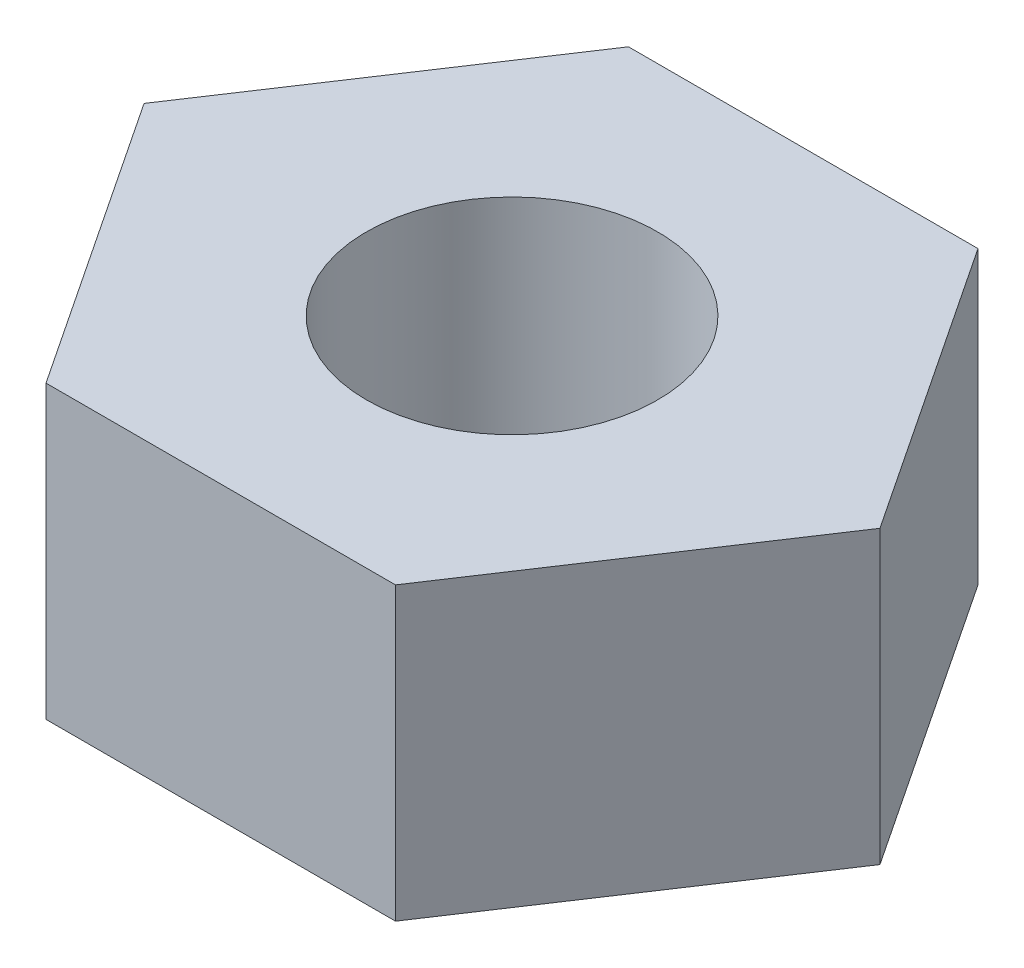
ISO-10303-21;
HEADER;
FILE_DESCRIPTION(('STEP AP214'),'2;1');
FILE_NAME('part.step','',(''),(''),'','','');
FILE_SCHEMA(('AUTOMOTIVE_DESIGN { 1 0 10303 214 1 1 1 1 }'));
ENDSEC;
DATA;
#1=APPLICATION_CONTEXT('core data for automotive mechanical design processes');
#2=APPLICATION_PROTOCOL_DEFINITION('international standard','automotive_design',2000,#1);
#3=PRODUCT_CONTEXT('',#1,'mechanical');
#4=PRODUCT('Part','Part','',(#3));
#5=PRODUCT_RELATED_PRODUCT_CATEGORY('part','',(#4));
#6=PRODUCT_DEFINITION_FORMATION('','',#4);
#7=PRODUCT_DEFINITION_CONTEXT('part definition',#1,'design');
#8=PRODUCT_DEFINITION('design','',#6,#7);
#9=PRODUCT_DEFINITION_SHAPE('','',#8);
#10=(LENGTH_UNIT() NAMED_UNIT(*) SI_UNIT(.MILLI.,.METRE.));
#11=(NAMED_UNIT(*) PLANE_ANGLE_UNIT() SI_UNIT($,.RADIAN.));
#12=(NAMED_UNIT(*) SI_UNIT($,.STERADIAN.) SOLID_ANGLE_UNIT());
#13=UNCERTAINTY_MEASURE_WITH_UNIT(LENGTH_MEASURE(1.E-05),#10,'distance_accuracy_value','');
#14=(GEOMETRIC_REPRESENTATION_CONTEXT(3) GLOBAL_UNCERTAINTY_ASSIGNED_CONTEXT((#13)) GLOBAL_UNIT_ASSIGNED_CONTEXT((#10,
#11,#12)) REPRESENTATION_CONTEXT('',''));
#15=CARTESIAN_POINT('',(0.,0.,0.));
#16=DIRECTION('',(0.,0.,1.));
#17=DIRECTION('',(1.,0.,0.));
#18=AXIS2_PLACEMENT_3D('',#15,#16,#17);
#19=CARTESIAN_POINT('',(0.,10.,0.));
#20=DIRECTION('',(0.,-1.,0.));
#21=DIRECTION('',(0.,0.,-1.));
#22=AXIS2_PLACEMENT_3D('',#19,#20,#21);
#23=PLANE('',#22);
#24=DIRECTION('',(-0.552770798392566,0.,0.833333333333333));
#25=VECTOR('',#24,1.);
#26=CARTESIAN_POINT('',(-12.635,10.,0.));
#27=LINE('',#26,#25);
#28=CARTESIAN_POINT('',(-6.0017504192892,10.,-10.));
#29=VERTEX_POINT('',#28);
#30=CARTESIAN_POINT('',(-12.635,10.,0.));
#31=VERTEX_POINT('',#30);
#32=EDGE_CURVE('E150',#29,#31,#27,.T.);
#33=ORIENTED_EDGE('',*,*,#32,.T.);
#34=DIRECTION('',(0.552770798392566,0.,0.833333333333333));
#35=VECTOR('',#34,1.);
#36=CARTESIAN_POINT('',(-6.0017504192892,10.,10.));
#37=LINE('',#36,#35);
#38=CARTESIAN_POINT('',(-6.0017504192892,10.,10.));
#39=VERTEX_POINT('',#38);
#40=EDGE_CURVE('E98',#31,#39,#37,.T.);
#41=ORIENTED_EDGE('',*,*,#40,.T.);
#42=DIRECTION('',(1.,0.,0.));
#43=VECTOR('',#42,1.);
#44=CARTESIAN_POINT('',(5.9982495807108,10.,10.));
#45=LINE('',#44,#43);
#46=CARTESIAN_POINT('',(5.9982495807108,10.,10.));
#47=VERTEX_POINT('',#46);
#48=EDGE_CURVE('E111',#39,#47,#45,.T.);
#49=ORIENTED_EDGE('',*,*,#48,.T.);
#50=DIRECTION('',(0.552770798392567,0.,-0.833333333333333));
#51=VECTOR('',#50,1.);
#52=CARTESIAN_POINT('',(12.6314991614216,10.,0.));
#53=LINE('',#52,#51);
#54=CARTESIAN_POINT('',(12.6314991614216,10.,0.));
#55=VERTEX_POINT('',#54);
#56=EDGE_CURVE('E105',#47,#55,#53,.T.);
#57=ORIENTED_EDGE('',*,*,#56,.T.);
#58=DIRECTION('',(-0.552770798392567,0.,-0.833333333333333));
#59=VECTOR('',#58,1.);
#60=CARTESIAN_POINT('',(5.9982495807108,10.,-10.));
#61=LINE('',#60,#59);
#62=CARTESIAN_POINT('',(5.9982495807108,10.,-10.));
#63=VERTEX_POINT('',#62);
#64=EDGE_CURVE('E109',#55,#63,#61,.T.);
#65=ORIENTED_EDGE('',*,*,#64,.T.);
#66=DIRECTION('',(-1.,0.,0.));
#67=VECTOR('',#66,1.);
#68=CARTESIAN_POINT('',(-6.0017504192892,10.,-10.));
#69=LINE('',#68,#67);
#70=EDGE_CURVE('E61',#63,#29,#69,.T.);
#71=ORIENTED_EDGE('',*,*,#70,.T.);
#72=EDGE_LOOP('',(#33,#41,#49,#57,#65,#71));
#73=FACE_BOUND('',#72,.T.);
#74=CARTESIAN_POINT('',(0.,10.,0.));
#75=DIRECTION('',(0.,1.,0.));
#76=DIRECTION('',(0.,0.,1.));
#77=AXIS2_PLACEMENT_3D('',#74,#75,#76);
#78=CIRCLE('',#77,5.);
#79=CARTESIAN_POINT('',(0.,10.,5.));
#80=VERTEX_POINT('',#79);
#81=EDGE_CURVE('E138',#80,#80,#78,.T.);
#82=ORIENTED_EDGE('',*,*,#81,.F.);
#83=EDGE_LOOP('',(#82));
#84=FACE_BOUND('',#83,.T.);
#85=ADVANCED_FACE('F43',(#73,#84),#23,.F.);
#86=CARTESIAN_POINT('',(0.,0.,0.));
#87=DIRECTION('',(0.,-1.,0.));
#88=DIRECTION('',(0.,0.,-1.));
#89=AXIS2_PLACEMENT_3D('',#86,#87,#88);
#90=PLANE('',#89);
#91=DIRECTION('',(-0.552770798392566,0.,0.833333333333333));
#92=VECTOR('',#91,1.);
#93=CARTESIAN_POINT('',(-12.635,0.,0.));
#94=LINE('',#93,#92);
#95=CARTESIAN_POINT('',(-6.0017504192892,0.,-10.));
#96=VERTEX_POINT('',#95);
#97=CARTESIAN_POINT('',(-12.635,0.,0.));
#98=VERTEX_POINT('',#97);
#99=EDGE_CURVE('E133',#96,#98,#94,.T.);
#100=ORIENTED_EDGE('',*,*,#99,.F.);
#101=DIRECTION('',(-1.,0.,0.));
#102=VECTOR('',#101,1.);
#103=CARTESIAN_POINT('',(-6.0017504192892,0.,-10.));
#104=LINE('',#103,#102);
#105=CARTESIAN_POINT('',(5.9982495807108,0.,-10.));
#106=VERTEX_POINT('',#105);
#107=EDGE_CURVE('E90',#106,#96,#104,.T.);
#108=ORIENTED_EDGE('',*,*,#107,.F.);
#109=DIRECTION('',(-0.552770798392567,0.,-0.833333333333333));
#110=VECTOR('',#109,1.);
#111=CARTESIAN_POINT('',(5.9982495807108,0.,-10.));
#112=LINE('',#111,#110);
#113=CARTESIAN_POINT('',(12.6314991614216,0.,0.));
#114=VERTEX_POINT('',#113);
#115=EDGE_CURVE('E84',#114,#106,#112,.T.);
#116=ORIENTED_EDGE('',*,*,#115,.F.);
#117=DIRECTION('',(0.552770798392567,0.,-0.833333333333333));
#118=VECTOR('',#117,1.);
#119=CARTESIAN_POINT('',(12.6314991614216,0.,0.));
#120=LINE('',#119,#118);
#121=CARTESIAN_POINT('',(5.9982495807108,0.,10.));
#122=VERTEX_POINT('',#121);
#123=EDGE_CURVE('E120',#122,#114,#120,.T.);
#124=ORIENTED_EDGE('',*,*,#123,.F.);
#125=DIRECTION('',(1.,0.,0.));
#126=VECTOR('',#125,1.);
#127=CARTESIAN_POINT('',(5.9982495807108,0.,10.));
#128=LINE('',#127,#126);
#129=CARTESIAN_POINT('',(-6.0017504192892,0.,10.));
#130=VERTEX_POINT('',#129);
#131=EDGE_CURVE('E141',#130,#122,#128,.T.);
#132=ORIENTED_EDGE('',*,*,#131,.F.);
#133=DIRECTION('',(0.552770798392566,0.,0.833333333333333));
#134=VECTOR('',#133,1.);
#135=CARTESIAN_POINT('',(-6.0017504192892,0.,10.));
#136=LINE('',#135,#134);
#137=EDGE_CURVE('E137',#98,#130,#136,.T.);
#138=ORIENTED_EDGE('',*,*,#137,.F.);
#139=EDGE_LOOP('',(#100,#108,#116,#124,#132,#138));
#140=FACE_BOUND('',#139,.T.);
#141=CARTESIAN_POINT('',(0.,0.,0.));
#142=DIRECTION('',(0.,1.,0.));
#143=DIRECTION('',(0.,0.,1.));
#144=AXIS2_PLACEMENT_3D('',#141,#142,#143);
#145=CIRCLE('',#144,5.);
#146=CARTESIAN_POINT('',(0.,0.,5.));
#147=VERTEX_POINT('',#146);
#148=EDGE_CURVE('E265',#147,#147,#145,.T.);
#149=ORIENTED_EDGE('',*,*,#148,.T.);
#150=EDGE_LOOP('',(#149));
#151=FACE_BOUND('',#150,.T.);
#152=ADVANCED_FACE('F163',(#140,#151),#90,.T.);
#153=CARTESIAN_POINT('',(-12.635,10.,0.));
#154=DIRECTION('',(0.833333333333333,0.,0.552770798392566));
#155=DIRECTION('',(0.552770798392566,0.,-0.833333333333334));
#156=AXIS2_PLACEMENT_3D('',#153,#154,#155);
#157=PLANE('',#156);
#158=ORIENTED_EDGE('',*,*,#99,.T.);
#159=DIRECTION('',(0.,-1.,0.));
#160=VECTOR('',#159,1.);
#161=CARTESIAN_POINT('',(-12.635,10.,0.));
#162=LINE('',#161,#160);
#163=EDGE_CURVE('E11',#31,#98,#162,.T.);
#164=ORIENTED_EDGE('',*,*,#163,.F.);
#165=ORIENTED_EDGE('',*,*,#32,.F.);
#166=DIRECTION('',(0.,-1.,0.));
#167=VECTOR('',#166,1.);
#168=CARTESIAN_POINT('',(-6.0017504192892,10.,-10.));
#169=LINE('',#168,#167);
#170=EDGE_CURVE('E129',#29,#96,#169,.T.);
#171=ORIENTED_EDGE('',*,*,#170,.T.);
#172=EDGE_LOOP('',(#158,#164,#165,#171));
#173=FACE_BOUND('',#172,.T.);
#174=ADVANCED_FACE('F45',(#173),#157,.F.);
#175=CARTESIAN_POINT('',(-6.0017504192892,10.,10.));
#176=DIRECTION('',(0.833333333333333,0.,-0.552770798392566));
#177=DIRECTION('',(-0.552770798392566,0.,-0.833333333333334));
#178=AXIS2_PLACEMENT_3D('',#175,#176,#177);
#179=PLANE('',#178);
#180=ORIENTED_EDGE('',*,*,#137,.T.);
#181=DIRECTION('',(0.,-1.,0.));
#182=VECTOR('',#181,1.);
#183=CARTESIAN_POINT('',(-6.0017504192892,10.,10.));
#184=LINE('',#183,#182);
#185=EDGE_CURVE('E53',#39,#130,#184,.T.);
#186=ORIENTED_EDGE('',*,*,#185,.F.);
#187=ORIENTED_EDGE('',*,*,#40,.F.);
#188=ORIENTED_EDGE('',*,*,#163,.T.);
#189=EDGE_LOOP('',(#180,#186,#187,#188));
#190=FACE_BOUND('',#189,.T.);
#191=ADVANCED_FACE('F188',(#190),#179,.F.);
#192=CARTESIAN_POINT('',(5.9982495807108,10.,10.));
#193=DIRECTION('',(0.,0.,-1.));
#194=DIRECTION('',(-1.,0.,0.));
#195=AXIS2_PLACEMENT_3D('',#192,#193,#194);
#196=PLANE('',#195);
#197=ORIENTED_EDGE('',*,*,#131,.T.);
#198=DIRECTION('',(0.,-1.,0.));
#199=VECTOR('',#198,1.);
#200=CARTESIAN_POINT('',(5.9982495807108,10.,10.));
#201=LINE('',#200,#199);
#202=EDGE_CURVE('E122',#47,#122,#201,.T.);
#203=ORIENTED_EDGE('',*,*,#202,.F.);
#204=ORIENTED_EDGE('',*,*,#48,.F.);
#205=ORIENTED_EDGE('',*,*,#185,.T.);
#206=EDGE_LOOP('',(#197,#203,#204,#205));
#207=FACE_BOUND('',#206,.T.);
#208=ADVANCED_FACE('F160',(#207),#196,.F.);
#209=CARTESIAN_POINT('',(12.6314991614216,10.,0.));
#210=DIRECTION('',(-0.833333333333333,0.,-0.552770798392567));
#211=DIRECTION('',(-0.552770798392567,0.,0.833333333333333));
#212=AXIS2_PLACEMENT_3D('',#209,#210,#211);
#213=PLANE('',#212);
#214=ORIENTED_EDGE('',*,*,#123,.T.);
#215=DIRECTION('',(0.,-1.,0.));
#216=VECTOR('',#215,1.);
#217=CARTESIAN_POINT('',(12.6314991614216,10.,0.));
#218=LINE('',#217,#216);
#219=EDGE_CURVE('E117',#55,#114,#218,.T.);
#220=ORIENTED_EDGE('',*,*,#219,.F.);
#221=ORIENTED_EDGE('',*,*,#56,.F.);
#222=ORIENTED_EDGE('',*,*,#202,.T.);
#223=EDGE_LOOP('',(#214,#220,#221,#222));
#224=FACE_BOUND('',#223,.T.);
#225=ADVANCED_FACE('F118',(#224),#213,.F.);
#226=CARTESIAN_POINT('',(5.9982495807108,10.,-10.));
#227=DIRECTION('',(-0.833333333333333,0.,0.552770798392567));
#228=DIRECTION('',(0.552770798392567,0.,0.833333333333333));
#229=AXIS2_PLACEMENT_3D('',#226,#227,#228);
#230=PLANE('',#229);
#231=ORIENTED_EDGE('',*,*,#115,.T.);
#232=DIRECTION('',(0.,-1.,0.));
#233=VECTOR('',#232,1.);
#234=CARTESIAN_POINT('',(5.9982495807108,10.,-10.));
#235=LINE('',#234,#233);
#236=EDGE_CURVE('E123',#63,#106,#235,.T.);
#237=ORIENTED_EDGE('',*,*,#236,.F.);
#238=ORIENTED_EDGE('',*,*,#64,.F.);
#239=ORIENTED_EDGE('',*,*,#219,.T.);
#240=EDGE_LOOP('',(#231,#237,#238,#239));
#241=FACE_BOUND('',#240,.T.);
#242=ADVANCED_FACE('F125',(#241),#230,.F.);
#243=CARTESIAN_POINT('',(-6.0017504192892,10.,-10.));
#244=DIRECTION('',(0.,0.,1.));
#245=DIRECTION('',(1.,0.,0.));
#246=AXIS2_PLACEMENT_3D('',#243,#244,#245);
#247=PLANE('',#246);
#248=ORIENTED_EDGE('',*,*,#107,.T.);
#249=ORIENTED_EDGE('',*,*,#170,.F.);
#250=ORIENTED_EDGE('',*,*,#70,.F.);
#251=ORIENTED_EDGE('',*,*,#236,.T.);
#252=EDGE_LOOP('',(#248,#249,#250,#251));
#253=FACE_BOUND('',#252,.T.);
#254=ADVANCED_FACE('F168',(#253),#247,.F.);
#255=CARTESIAN_POINT('',(0.,10.,0.));
#256=DIRECTION('',(0.,-1.,0.));
#257=DIRECTION('',(0.,0.,-1.));
#258=AXIS2_PLACEMENT_3D('',#255,#256,#257);
#259=CYLINDRICAL_SURFACE('',#258,5.);
#260=ORIENTED_EDGE('',*,*,#81,.T.);
#261=EDGE_LOOP('',(#260));
#262=FACE_BOUND('',#261,.T.);
#263=ORIENTED_EDGE('',*,*,#148,.F.);
#264=EDGE_LOOP('',(#263));
#265=FACE_BOUND('',#264,.T.);
#266=ADVANCED_FACE('F170',(#262,#265),#259,.F.);
#267=CLOSED_SHELL('',(#85,#152,#174,#191,#208,#225,#242,#254,#266));
#268=MANIFOLD_SOLID_BREP('B2',#267);
#269=ADVANCED_BREP_SHAPE_REPRESENTATION('',(#18,#268),#14);
#270=SHAPE_DEFINITION_REPRESENTATION(#9,#269);
ENDSEC;
END-ISO-10303-21;
